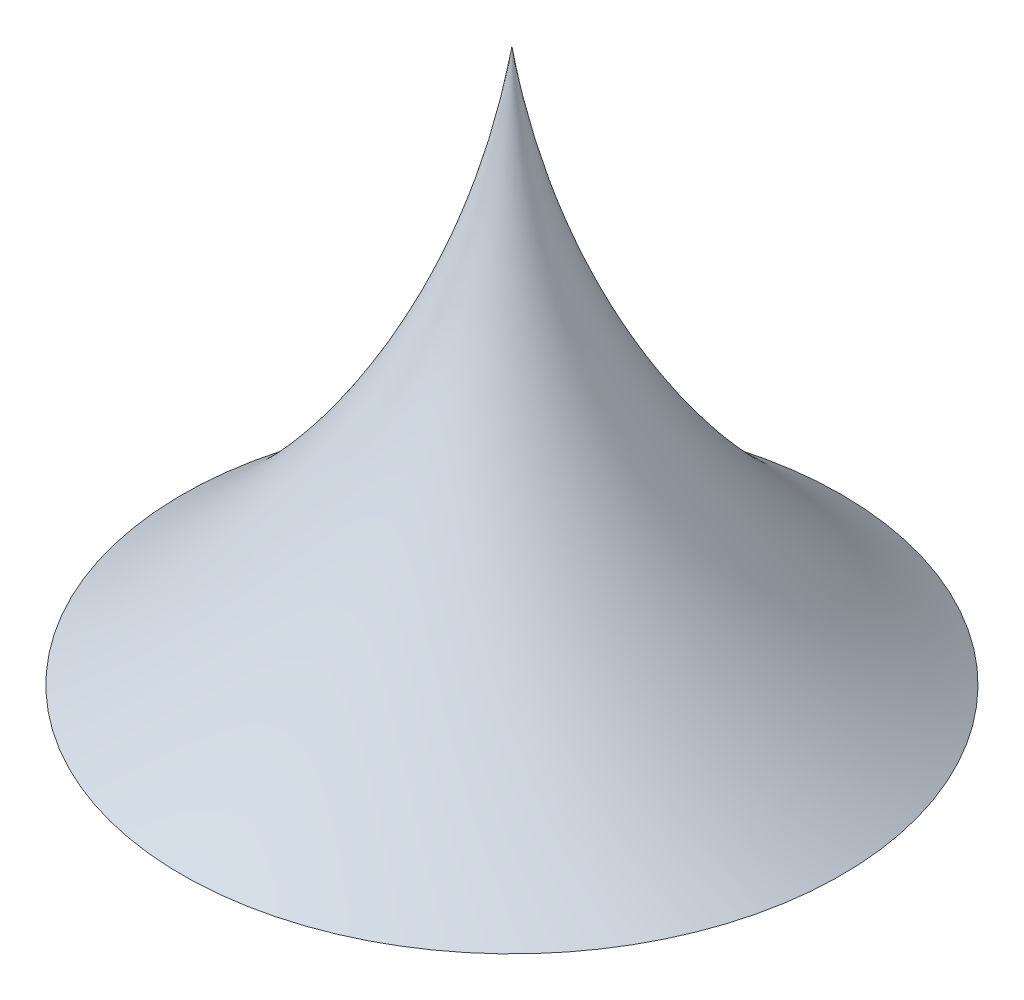
ISO-10303-21;
HEADER;
FILE_DESCRIPTION(('STEP AP214'),'2;1');
FILE_NAME('part.step','',(''),(''),'','','');
FILE_SCHEMA(('AUTOMOTIVE_DESIGN { 1 0 10303 214 1 1 1 1 }'));
ENDSEC;
DATA;
#1=APPLICATION_CONTEXT('core data for automotive mechanical design processes');
#2=APPLICATION_PROTOCOL_DEFINITION('international standard','automotive_design',2000,#1);
#3=PRODUCT_CONTEXT('',#1,'mechanical');
#4=PRODUCT('Part','Part','',(#3));
#5=PRODUCT_RELATED_PRODUCT_CATEGORY('part','',(#4));
#6=PRODUCT_DEFINITION_FORMATION('','',#4);
#7=PRODUCT_DEFINITION_CONTEXT('part definition',#1,'design');
#8=PRODUCT_DEFINITION('design','',#6,#7);
#9=PRODUCT_DEFINITION_SHAPE('','',#8);
#10=(LENGTH_UNIT() NAMED_UNIT(*) SI_UNIT(.MILLI.,.METRE.));
#11=(NAMED_UNIT(*) PLANE_ANGLE_UNIT() SI_UNIT($,.RADIAN.));
#12=(NAMED_UNIT(*) SI_UNIT($,.STERADIAN.) SOLID_ANGLE_UNIT());
#13=UNCERTAINTY_MEASURE_WITH_UNIT(LENGTH_MEASURE(1.E-05),#10,'distance_accuracy_value','');
#14=(GEOMETRIC_REPRESENTATION_CONTEXT(3) GLOBAL_UNCERTAINTY_ASSIGNED_CONTEXT((#13)) GLOBAL_UNIT_ASSIGNED_CONTEXT((#10,
#11,#12)) REPRESENTATION_CONTEXT('',''));
#15=CARTESIAN_POINT('',(0.,0.,0.));
#16=DIRECTION('',(0.,0.,1.));
#17=DIRECTION('',(1.,0.,0.));
#18=AXIS2_PLACEMENT_3D('',#15,#16,#17);
#19=CARTESIAN_POINT('',(0.,71.9252580472439,-74.1664868493269));
#20=DIRECTION('',(-1.,0.,0.));
#21=DIRECTION('',(0.,0.,-1.));
#22=AXIS2_PLACEMENT_3D('',#19,#20,#21);
#23=CIRCLE('',#22,75.);
#24=TRIMMED_CURVE('',#23,(PARAMETER_VALUE(-2.99236695263492)),
(PARAMETER_VALUE(2.99236695263492)),.T.,.PARAMETER.);
#25=CARTESIAN_POINT('',(0.,71.9252580472439,0.));
#26=DIRECTION('',(0.,-1.,0.));
#27=AXIS1_PLACEMENT('',#25,#26);
#28=SURFACE_OF_REVOLUTION('',#24,#27);
#29=CARTESIAN_POINT('',(0.,12.,0.));
#30=DIRECTION('',(0.,-1.,0.));
#31=DIRECTION('',(0.,0.,-1.));
#32=AXIS2_PLACEMENT_3D('',#29,#30,#31);
#33=CIRCLE('',#32,29.0670029501598);
#34=CARTESIAN_POINT('',(0.,12.,-29.0670029501599));
#35=VERTEX_POINT('',#34);
#36=EDGE_CURVE('E11',#35,#35,#33,.T.);
#37=ORIENTED_EDGE('',*,*,#36,.F.);
#38=EDGE_LOOP('',(#37));
#39=FACE_BOUND('',#38,.T.);
#40=CARTESIAN_POINT('',(0.,60.7748218033732,0.));
#41=VERTEX_POINT('',#40);
#42=VERTEX_LOOP('',#41);
#43=FACE_BOUND('',#42,.T.);
#44=ADVANCED_FACE('F39',(#39,#43),#28,.F.);
#45=CARTESIAN_POINT('',(-52.9119048765528,12.,-70.504792413999));
#46=DIRECTION('',(0.,1.,0.));
#47=DIRECTION('',(0.,0.,1.));
#48=AXIS2_PLACEMENT_3D('',#45,#46,#47);
#49=PLANE('',#48);
#50=DIRECTION('',(-0.214375979284471,0.,-0.9767512167926));
#51=VECTOR('',#50,1.);
#52=CARTESIAN_POINT('',(-5.41643054027525,12.,4.94222758841667));
#53=LINE('',#52,#51);
#54=CARTESIAN_POINT('',(-5.41643054027525,12.,4.94222758841667));
#55=VERTEX_POINT('',#54);
#56=CARTESIAN_POINT('',(-6.98830991299077,12.,-2.21965265150391));
#57=VERTEX_POINT('',#56);
#58=EDGE_CURVE('E122',#55,#57,#53,.T.);
#59=ORIENTED_EDGE('',*,*,#58,.F.);
#60=DIRECTION('',(-0.953079356561988,0.,-0.302720564374781));
#61=VECTOR('',#60,1.);
#62=CARTESIAN_POINT('',(1.57187937271552,12.,7.16188023992056));
#63=LINE('',#62,#61);
#64=CARTESIAN_POINT('',(1.57187937271552,12.,7.16188023992056));
#65=VERTEX_POINT('',#64);
#66=EDGE_CURVE('E52',#65,#55,#63,.T.);
#67=ORIENTED_EDGE('',*,*,#66,.F.);
#68=DIRECTION('',(-0.738703377277517,0.,0.674030652417818));
#69=VECTOR('',#68,1.);
#70=CARTESIAN_POINT('',(6.98830991299077,12.,2.21965265150389));
#71=LINE('',#70,#69);
#72=CARTESIAN_POINT('',(6.98830991299077,12.,2.21965265150389));
#73=VERTEX_POINT('',#72);
#74=EDGE_CURVE('E112',#73,#65,#71,.T.);
#75=ORIENTED_EDGE('',*,*,#74,.F.);
#76=DIRECTION('',(0.214375979284471,0.,0.9767512167926));
#77=VECTOR('',#76,1.);
#78=CARTESIAN_POINT('',(5.41643054027525,12.,-4.94222758841669));
#79=LINE('',#78,#77);
#80=CARTESIAN_POINT('',(5.41643054027525,12.,-4.94222758841669));
#81=VERTEX_POINT('',#80);
#82=EDGE_CURVE('E111',#81,#73,#79,.T.);
#83=ORIENTED_EDGE('',*,*,#82,.F.);
#84=DIRECTION('',(0.953079356561988,0.,0.302720564374782));
#85=VECTOR('',#84,1.);
#86=CARTESIAN_POINT('',(-1.57187937271552,12.,-7.16188023992059));
#87=LINE('',#86,#85);
#88=CARTESIAN_POINT('',(-1.57187937271552,12.,-7.16188023992059));
#89=VERTEX_POINT('',#88);
#90=EDGE_CURVE('E128',#89,#81,#87,.T.);
#91=ORIENTED_EDGE('',*,*,#90,.F.);
#92=DIRECTION('',(0.738703377277517,0.,-0.674030652417818));
#93=VECTOR('',#92,1.);
#94=CARTESIAN_POINT('',(-6.98830991299077,12.,-2.21965265150391));
#95=LINE('',#94,#93);
#96=EDGE_CURVE('E130',#57,#89,#95,.T.);
#97=ORIENTED_EDGE('',*,*,#96,.F.);
#98=EDGE_LOOP('',(#59,#67,#75,#83,#91,#97));
#99=FACE_BOUND('',#98,.T.);
#100=ORIENTED_EDGE('',*,*,#36,.T.);
#101=EDGE_LOOP('',(#100));
#102=FACE_BOUND('',#101,.T.);
#103=ADVANCED_FACE('F150',(#99,#102),#49,.F.);
#104=CARTESIAN_POINT('',(1.57187937271552,32.,7.16188023992057));
#105=DIRECTION('',(-0.302720564374781,0.,0.953079356561988));
#106=DIRECTION('',(0.953079356561988,0.,0.302720564374781));
#107=AXIS2_PLACEMENT_3D('',#104,#105,#106);
#108=PLANE('',#107);
#109=ORIENTED_EDGE('',*,*,#66,.T.);
#110=DIRECTION('',(0.,-1.,0.));
#111=VECTOR('',#110,1.);
#112=CARTESIAN_POINT('',(-5.41643054027525,32.,4.94222758841667));
#113=LINE('',#112,#111);
#114=CARTESIAN_POINT('',(-5.41643054027525,32.,4.94222758841667));
#115=VERTEX_POINT('',#114);
#116=EDGE_CURVE('E90',#115,#55,#113,.T.);
#117=ORIENTED_EDGE('',*,*,#116,.F.);
#118=DIRECTION('',(-0.953079356561988,0.,-0.302720564374781));
#119=VECTOR('',#118,1.);
#120=CARTESIAN_POINT('',(1.57187937271552,32.,7.16188023992057));
#121=LINE('',#120,#119);
#122=CARTESIAN_POINT('',(1.57187937271552,32.,7.16188023992057));
#123=VERTEX_POINT('',#122);
#124=EDGE_CURVE('E91',#123,#115,#121,.T.);
#125=ORIENTED_EDGE('',*,*,#124,.F.);
#126=DIRECTION('',(0.,-1.,0.));
#127=VECTOR('',#126,1.);
#128=CARTESIAN_POINT('',(1.57187937271552,32.,7.16188023992057));
#129=LINE('',#128,#127);
#130=EDGE_CURVE('E46',#123,#65,#129,.T.);
#131=ORIENTED_EDGE('',*,*,#130,.T.);
#132=EDGE_LOOP('',(#109,#117,#125,#131));
#133=FACE_BOUND('',#132,.T.);
#134=ADVANCED_FACE('F93',(#133),#108,.F.);
#135=CARTESIAN_POINT('',(6.98830991299077,32.,2.21965265150389));
#136=DIRECTION('',(0.674030652417818,0.,0.738703377277517));
#137=DIRECTION('',(0.738703377277517,0.,-0.674030652417818));
#138=AXIS2_PLACEMENT_3D('',#135,#136,#137);
#139=PLANE('',#138);
#140=ORIENTED_EDGE('',*,*,#74,.T.);
#141=ORIENTED_EDGE('',*,*,#130,.F.);
#142=DIRECTION('',(-0.738703377277517,0.,0.674030652417818));
#143=VECTOR('',#142,1.);
#144=CARTESIAN_POINT('',(6.98830991299077,32.,2.21965265150389));
#145=LINE('',#144,#143);
#146=CARTESIAN_POINT('',(6.98830991299077,32.,2.21965265150389));
#147=VERTEX_POINT('',#146);
#148=EDGE_CURVE('E97',#147,#123,#145,.T.);
#149=ORIENTED_EDGE('',*,*,#148,.F.);
#150=DIRECTION('',(0.,-1.,0.));
#151=VECTOR('',#150,1.);
#152=CARTESIAN_POINT('',(6.98830991299077,32.,2.21965265150389));
#153=LINE('',#152,#151);
#154=EDGE_CURVE('E139',#147,#73,#153,.T.);
#155=ORIENTED_EDGE('',*,*,#154,.T.);
#156=EDGE_LOOP('',(#140,#141,#149,#155));
#157=FACE_BOUND('',#156,.T.);
#158=ADVANCED_FACE('F160',(#157),#139,.F.);
#159=CARTESIAN_POINT('',(5.41643054027525,32.,-4.94222758841669));
#160=DIRECTION('',(0.9767512167926,0.,-0.214375979284471));
#161=DIRECTION('',(-0.214375979284471,0.,-0.9767512167926));
#162=AXIS2_PLACEMENT_3D('',#159,#160,#161);
#163=PLANE('',#162);
#164=ORIENTED_EDGE('',*,*,#82,.T.);
#165=ORIENTED_EDGE('',*,*,#154,.F.);
#166=DIRECTION('',(0.214375979284471,0.,0.9767512167926));
#167=VECTOR('',#166,1.);
#168=CARTESIAN_POINT('',(5.41643054027525,32.,-4.94222758841669));
#169=LINE('',#168,#167);
#170=CARTESIAN_POINT('',(5.41643054027525,32.,-4.94222758841669));
#171=VERTEX_POINT('',#170);
#172=EDGE_CURVE('E124',#171,#147,#169,.T.);
#173=ORIENTED_EDGE('',*,*,#172,.F.);
#174=DIRECTION('',(0.,-1.,0.));
#175=VECTOR('',#174,1.);
#176=CARTESIAN_POINT('',(5.41643054027525,32.,-4.94222758841669));
#177=LINE('',#176,#175);
#178=EDGE_CURVE('E140',#171,#81,#177,.T.);
#179=ORIENTED_EDGE('',*,*,#178,.T.);
#180=EDGE_LOOP('',(#164,#165,#173,#179));
#181=FACE_BOUND('',#180,.T.);
#182=ADVANCED_FACE('F158',(#181),#163,.F.);
#183=CARTESIAN_POINT('',(-1.57187937271552,32.,-7.16188023992058));
#184=DIRECTION('',(0.302720564374782,0.,-0.953079356561988));
#185=DIRECTION('',(-0.953079356561988,0.,-0.302720564374782));
#186=AXIS2_PLACEMENT_3D('',#183,#184,#185);
#187=PLANE('',#186);
#188=ORIENTED_EDGE('',*,*,#90,.T.);
#189=ORIENTED_EDGE('',*,*,#178,.F.);
#190=DIRECTION('',(0.953079356561988,0.,0.302720564374782));
#191=VECTOR('',#190,1.);
#192=CARTESIAN_POINT('',(-1.57187937271552,32.,-7.16188023992058));
#193=LINE('',#192,#191);
#194=CARTESIAN_POINT('',(-1.57187937271552,32.,-7.16188023992058));
#195=VERTEX_POINT('',#194);
#196=EDGE_CURVE('E119',#195,#171,#193,.T.);
#197=ORIENTED_EDGE('',*,*,#196,.F.);
#198=DIRECTION('',(0.,-1.,0.));
#199=VECTOR('',#198,1.);
#200=CARTESIAN_POINT('',(-1.57187937271552,32.,-7.16188023992058));
#201=LINE('',#200,#199);
#202=EDGE_CURVE('E137',#195,#89,#201,.T.);
#203=ORIENTED_EDGE('',*,*,#202,.T.);
#204=EDGE_LOOP('',(#188,#189,#197,#203));
#205=FACE_BOUND('',#204,.T.);
#206=ADVANCED_FACE('F155',(#205),#187,.F.);
#207=CARTESIAN_POINT('',(-6.98830991299077,32.,-2.2196526515039));
#208=DIRECTION('',(-0.674030652417818,0.,-0.738703377277517));
#209=DIRECTION('',(-0.738703377277517,0.,0.674030652417818));
#210=AXIS2_PLACEMENT_3D('',#207,#208,#209);
#211=PLANE('',#210);
#212=ORIENTED_EDGE('',*,*,#96,.T.);
#213=ORIENTED_EDGE('',*,*,#202,.F.);
#214=DIRECTION('',(0.738703377277517,0.,-0.674030652417818));
#215=VECTOR('',#214,1.);
#216=CARTESIAN_POINT('',(-6.98830991299077,32.,-2.2196526515039));
#217=LINE('',#216,#215);
#218=CARTESIAN_POINT('',(-6.98830991299077,32.,-2.2196526515039));
#219=VERTEX_POINT('',#218);
#220=EDGE_CURVE('E106',#219,#195,#217,.T.);
#221=ORIENTED_EDGE('',*,*,#220,.F.);
#222=DIRECTION('',(0.,-1.,0.));
#223=VECTOR('',#222,1.);
#224=CARTESIAN_POINT('',(-6.98830991299077,32.,-2.2196526515039));
#225=LINE('',#224,#223);
#226=EDGE_CURVE('E98',#219,#57,#225,.T.);
#227=ORIENTED_EDGE('',*,*,#226,.T.);
#228=EDGE_LOOP('',(#212,#213,#221,#227));
#229=FACE_BOUND('',#228,.T.);
#230=ADVANCED_FACE('F141',(#229),#211,.F.);
#231=CARTESIAN_POINT('',(-5.41643054027525,32.,4.94222758841667));
#232=DIRECTION('',(-0.9767512167926,0.,0.214375979284471));
#233=DIRECTION('',(0.214375979284471,0.,0.9767512167926));
#234=AXIS2_PLACEMENT_3D('',#231,#232,#233);
#235=PLANE('',#234);
#236=ORIENTED_EDGE('',*,*,#58,.T.);
#237=ORIENTED_EDGE('',*,*,#226,.F.);
#238=DIRECTION('',(-0.214375979284471,0.,-0.9767512167926));
#239=VECTOR('',#238,1.);
#240=CARTESIAN_POINT('',(-5.41643054027525,32.,4.94222758841667));
#241=LINE('',#240,#239);
#242=EDGE_CURVE('E101',#115,#219,#241,.T.);
#243=ORIENTED_EDGE('',*,*,#242,.F.);
#244=ORIENTED_EDGE('',*,*,#116,.T.);
#245=EDGE_LOOP('',(#236,#237,#243,#244));
#246=FACE_BOUND('',#245,.T.);
#247=ADVANCED_FACE('F105',(#246),#235,.F.);
#248=CARTESIAN_POINT('',(0.,32.,0.));
#249=DIRECTION('',(0.,-1.,0.));
#250=DIRECTION('',(0.,0.,-1.));
#251=AXIS2_PLACEMENT_3D('',#248,#249,#250);
#252=PLANE('',#251);
#253=ORIENTED_EDGE('',*,*,#124,.T.);
#254=ORIENTED_EDGE('',*,*,#242,.T.);
#255=ORIENTED_EDGE('',*,*,#220,.T.);
#256=ORIENTED_EDGE('',*,*,#196,.T.);
#257=ORIENTED_EDGE('',*,*,#172,.T.);
#258=ORIENTED_EDGE('',*,*,#148,.T.);
#259=EDGE_LOOP('',(#253,#254,#255,#256,#257,#258));
#260=FACE_BOUND('',#259,.T.);
#261=ADVANCED_FACE('F107',(#260),#252,.T.);
#262=CLOSED_SHELL('',(#44,#103,#134,#158,#182,#206,#230,#247,#261));
#263=MANIFOLD_SOLID_BREP('B2',#262);
#264=ADVANCED_BREP_SHAPE_REPRESENTATION('',(#18,#263),#14);
#265=SHAPE_DEFINITION_REPRESENTATION(#9,#264);
ENDSEC;
END-ISO-10303-21;
